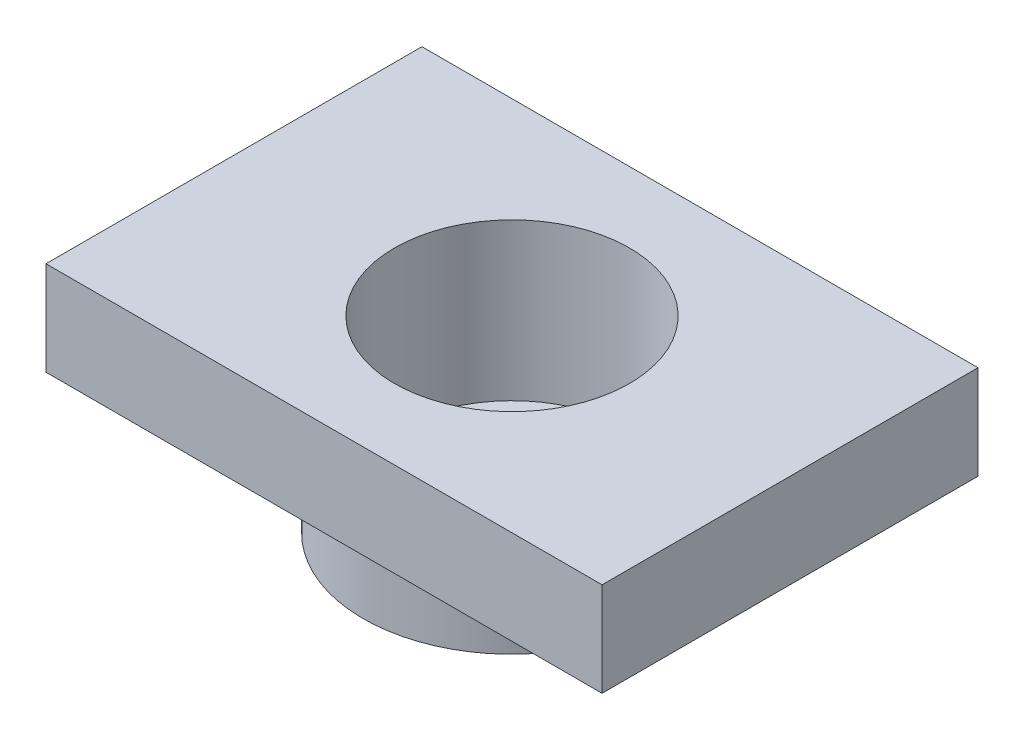
ISO-10303-21;
HEADER;
FILE_DESCRIPTION(('STEP AP214'),'2;1');
FILE_NAME('part.step','',(''),(''),'','','');
FILE_SCHEMA(('AUTOMOTIVE_DESIGN { 1 0 10303 214 1 1 1 1 }'));
ENDSEC;
DATA;
#1=APPLICATION_CONTEXT('core data for automotive mechanical design processes');
#2=APPLICATION_PROTOCOL_DEFINITION('international standard','automotive_design',2000,#1);
#3=PRODUCT_CONTEXT('',#1,'mechanical');
#4=PRODUCT('Part','Part','',(#3));
#5=PRODUCT_RELATED_PRODUCT_CATEGORY('part','',(#4));
#6=PRODUCT_DEFINITION_FORMATION('','',#4);
#7=PRODUCT_DEFINITION_CONTEXT('part definition',#1,'design');
#8=PRODUCT_DEFINITION('design','',#6,#7);
#9=PRODUCT_DEFINITION_SHAPE('','',#8);
#10=(LENGTH_UNIT() NAMED_UNIT(*) SI_UNIT(.MILLI.,.METRE.));
#11=(NAMED_UNIT(*) PLANE_ANGLE_UNIT() SI_UNIT($,.RADIAN.));
#12=(NAMED_UNIT(*) SI_UNIT($,.STERADIAN.) SOLID_ANGLE_UNIT());
#13=UNCERTAINTY_MEASURE_WITH_UNIT(LENGTH_MEASURE(1.E-05),#10,'distance_accuracy_value','');
#14=(GEOMETRIC_REPRESENTATION_CONTEXT(3) GLOBAL_UNCERTAINTY_ASSIGNED_CONTEXT((#13)) GLOBAL_UNIT_ASSIGNED_CONTEXT((#10,
#11,#12)) REPRESENTATION_CONTEXT('',''));
#15=CARTESIAN_POINT('',(0.,0.,0.));
#16=DIRECTION('',(0.,0.,1.));
#17=DIRECTION('',(1.,0.,0.));
#18=AXIS2_PLACEMENT_3D('',#15,#16,#17);
#19=CARTESIAN_POINT('',(59.,0.,0.));
#20=DIRECTION('',(0.,-1.,0.));
#21=DIRECTION('',(1.,0.,0.));
#22=AXIS2_PLACEMENT_3D('',#19,#20,#21);
#23=PLANE('',#22);
#24=CARTESIAN_POINT('',(0.,0.,0.));
#25=DIRECTION('',(0.,1.,0.));
#26=DIRECTION('',(-1.,0.,0.));
#27=AXIS2_PLACEMENT_3D('',#24,#25,#26);
#28=CIRCLE('',#27,15.);
#29=CARTESIAN_POINT('',(-15.,0.,0.));
#30=VERTEX_POINT('',#29);
#31=EDGE_CURVE('E122',#30,#30,#28,.T.);
#32=ORIENTED_EDGE('',*,*,#31,.F.);
#33=EDGE_LOOP('',(#32));
#34=FACE_BOUND('',#33,.T.);
#35=DIRECTION('',(1.,0.,0.));
#36=VECTOR('',#35,1.);
#37=CARTESIAN_POINT('',(35.5,0.,-24.));
#38=LINE('',#37,#36);
#39=CARTESIAN_POINT('',(-35.5000000000001,0.,-24.));
#40=VERTEX_POINT('',#39);
#41=CARTESIAN_POINT('',(35.5,0.,-24.));
#42=VERTEX_POINT('',#41);
#43=EDGE_CURVE('E48',#40,#42,#38,.T.);
#44=ORIENTED_EDGE('',*,*,#43,.F.);
#45=DIRECTION('',(0.,0.,-1.));
#46=VECTOR('',#45,1.);
#47=CARTESIAN_POINT('',(-35.5000000000001,0.,-24.));
#48=LINE('',#47,#46);
#49=CARTESIAN_POINT('',(-35.5000000000001,0.,24.));
#50=VERTEX_POINT('',#49);
#51=EDGE_CURVE('E78',#50,#40,#48,.T.);
#52=ORIENTED_EDGE('',*,*,#51,.F.);
#53=DIRECTION('',(-1.,0.,0.));
#54=VECTOR('',#53,1.);
#55=CARTESIAN_POINT('',(35.5,0.,24.));
#56=LINE('',#55,#54);
#57=CARTESIAN_POINT('',(35.5,0.,24.));
#58=VERTEX_POINT('',#57);
#59=EDGE_CURVE('E85',#58,#50,#56,.T.);
#60=ORIENTED_EDGE('',*,*,#59,.F.);
#61=DIRECTION('',(0.,0.,1.));
#62=VECTOR('',#61,1.);
#63=CARTESIAN_POINT('',(35.5,0.,-24.));
#64=LINE('',#63,#62);
#65=EDGE_CURVE('E90',#42,#58,#64,.T.);
#66=ORIENTED_EDGE('',*,*,#65,.F.);
#67=EDGE_LOOP('',(#44,#52,#60,#66));
#68=FACE_BOUND('',#67,.T.);
#69=ADVANCED_FACE('F32',(#34,#68),#23,.F.);
#70=CARTESIAN_POINT('',(19.,-12.,0.));
#71=DIRECTION('',(0.,1.,0.));
#72=DIRECTION('',(-1.,0.,0.));
#73=AXIS2_PLACEMENT_3D('',#70,#71,#72);
#74=PLANE('',#73);
#75=CARTESIAN_POINT('',(0.,-12.,0.));
#76=DIRECTION('',(0.,1.,0.));
#77=DIRECTION('',(-1.,0.,0.));
#78=AXIS2_PLACEMENT_3D('',#75,#76,#77);
#79=CIRCLE('',#78,19.);
#80=CARTESIAN_POINT('',(-19.,-12.,0.));
#81=VERTEX_POINT('',#80);
#82=EDGE_CURVE('E12',#81,#81,#79,.T.);
#83=ORIENTED_EDGE('',*,*,#82,.T.);
#84=EDGE_LOOP('',(#83));
#85=FACE_BOUND('',#84,.T.);
#86=DIRECTION('',(1.,0.,0.));
#87=VECTOR('',#86,1.);
#88=CARTESIAN_POINT('',(35.5,-12.,-24.));
#89=LINE('',#88,#87);
#90=CARTESIAN_POINT('',(-35.5000000000001,-12.,-24.));
#91=VERTEX_POINT('',#90);
#92=CARTESIAN_POINT('',(35.5,-12.,-24.));
#93=VERTEX_POINT('',#92);
#94=EDGE_CURVE('E97',#91,#93,#89,.T.);
#95=ORIENTED_EDGE('',*,*,#94,.T.);
#96=DIRECTION('',(0.,0.,1.));
#97=VECTOR('',#96,1.);
#98=CARTESIAN_POINT('',(35.5,-12.,-24.));
#99=LINE('',#98,#97);
#100=CARTESIAN_POINT('',(35.5,-12.,24.));
#101=VERTEX_POINT('',#100);
#102=EDGE_CURVE('E100',#93,#101,#99,.T.);
#103=ORIENTED_EDGE('',*,*,#102,.T.);
#104=DIRECTION('',(-1.,0.,0.));
#105=VECTOR('',#104,1.);
#106=CARTESIAN_POINT('',(35.5,-12.,24.));
#107=LINE('',#106,#105);
#108=CARTESIAN_POINT('',(-35.5000000000001,-12.,24.));
#109=VERTEX_POINT('',#108);
#110=EDGE_CURVE('E56',#101,#109,#107,.T.);
#111=ORIENTED_EDGE('',*,*,#110,.T.);
#112=DIRECTION('',(0.,0.,-1.));
#113=VECTOR('',#112,1.);
#114=CARTESIAN_POINT('',(-35.5000000000001,-12.,-24.));
#115=LINE('',#114,#113);
#116=EDGE_CURVE('E80',#109,#91,#115,.T.);
#117=ORIENTED_EDGE('',*,*,#116,.T.);
#118=EDGE_LOOP('',(#95,#103,#111,#117));
#119=FACE_BOUND('',#118,.T.);
#120=ADVANCED_FACE('F162',(#85,#119),#74,.F.);
#121=CARTESIAN_POINT('',(0.,0.,0.));
#122=DIRECTION('',(0.,1.,0.));
#123=DIRECTION('',(-1.,0.,0.));
#124=AXIS2_PLACEMENT_3D('',#121,#122,#123);
#125=CYLINDRICAL_SURFACE('',#124,19.);
#126=ORIENTED_EDGE('',*,*,#82,.F.);
#127=EDGE_LOOP('',(#126));
#128=FACE_BOUND('',#127,.T.);
#129=CARTESIAN_POINT('',(0.,-24.,0.));
#130=DIRECTION('',(0.,1.,0.));
#131=DIRECTION('',(-1.,0.,0.));
#132=AXIS2_PLACEMENT_3D('',#129,#130,#131);
#133=CIRCLE('',#132,19.);
#134=CARTESIAN_POINT('',(-19.,-24.,0.));
#135=VERTEX_POINT('',#134);
#136=EDGE_CURVE('E40',#135,#135,#133,.T.);
#137=ORIENTED_EDGE('',*,*,#136,.T.);
#138=EDGE_LOOP('',(#137));
#139=FACE_BOUND('',#138,.T.);
#140=ADVANCED_FACE('F167',(#128,#139),#125,.T.);
#141=CARTESIAN_POINT('',(9.,-24.,0.));
#142=DIRECTION('',(0.,1.,0.));
#143=DIRECTION('',(-1.,0.,0.));
#144=AXIS2_PLACEMENT_3D('',#141,#142,#143);
#145=PLANE('',#144);
#146=CARTESIAN_POINT('',(-12.9999999999998,-24.,-1.81557108488227E-13));
#147=DIRECTION('',(0.,-1.,0.));
#148=DIRECTION('',(1.,0.,0.));
#149=AXIS2_PLACEMENT_3D('',#146,#147,#148);
#150=CIRCLE('',#149,1.50000000000036);
#151=CARTESIAN_POINT('',(-11.4999999999995,-24.,-1.81557108488227E-13));
#152=VERTEX_POINT('',#151);
#153=EDGE_CURVE('E105',#152,#152,#150,.T.);
#154=ORIENTED_EDGE('',*,*,#153,.F.);
#155=EDGE_LOOP('',(#154));
#156=FACE_BOUND('',#155,.T.);
#157=CARTESIAN_POINT('',(3.6923745097219E-13,-24.,-13.));
#158=DIRECTION('',(0.,-1.,0.));
#159=DIRECTION('',(1.,0.,0.));
#160=AXIS2_PLACEMENT_3D('',#157,#158,#159);
#161=CIRCLE('',#160,1.50000000000044);
#162=CARTESIAN_POINT('',(1.50000000000081,-24.,-13.));
#163=VERTEX_POINT('',#162);
#164=EDGE_CURVE('E110',#163,#163,#161,.T.);
#165=ORIENTED_EDGE('',*,*,#164,.F.);
#166=EDGE_LOOP('',(#165));
#167=FACE_BOUND('',#166,.T.);
#168=CARTESIAN_POINT('',(13.,-24.,0.));
#169=DIRECTION('',(0.,-1.,0.));
#170=DIRECTION('',(1.,0.,0.));
#171=AXIS2_PLACEMENT_3D('',#168,#169,#170);
#172=CIRCLE('',#171,1.5);
#173=CARTESIAN_POINT('',(14.5,-24.,0.));
#174=VERTEX_POINT('',#173);
#175=EDGE_CURVE('E114',#174,#174,#172,.T.);
#176=ORIENTED_EDGE('',*,*,#175,.F.);
#177=EDGE_LOOP('',(#176));
#178=FACE_BOUND('',#177,.T.);
#179=CARTESIAN_POINT('',(0.,-24.,13.));
#180=DIRECTION('',(0.,-1.,0.));
#181=DIRECTION('',(1.,0.,0.));
#182=AXIS2_PLACEMENT_3D('',#179,#180,#181);
#183=CIRCLE('',#182,1.5);
#184=CARTESIAN_POINT('',(1.5,-24.,13.));
#185=VERTEX_POINT('',#184);
#186=EDGE_CURVE('E118',#185,#185,#183,.T.);
#187=ORIENTED_EDGE('',*,*,#186,.F.);
#188=EDGE_LOOP('',(#187));
#189=FACE_BOUND('',#188,.T.);
#190=ORIENTED_EDGE('',*,*,#136,.F.);
#191=EDGE_LOOP('',(#190));
#192=FACE_BOUND('',#191,.T.);
#193=CARTESIAN_POINT('',(0.,-24.,0.));
#194=DIRECTION('',(0.,1.,0.));
#195=DIRECTION('',(-1.,0.,0.));
#196=AXIS2_PLACEMENT_3D('',#193,#194,#195);
#197=CIRCLE('',#196,9.);
#198=CARTESIAN_POINT('',(-8.99999999999999,-24.,0.));
#199=VERTEX_POINT('',#198);
#200=EDGE_CURVE('E131',#199,#199,#197,.T.);
#201=ORIENTED_EDGE('',*,*,#200,.T.);
#202=EDGE_LOOP('',(#201));
#203=FACE_BOUND('',#202,.T.);
#204=ADVANCED_FACE('F188',(#156,#167,#178,#189,#192,#203),#145,.F.);
#205=CARTESIAN_POINT('',(0.,0.,0.));
#206=DIRECTION('',(0.,1.,0.));
#207=DIRECTION('',(-1.,0.,0.));
#208=AXIS2_PLACEMENT_3D('',#205,#206,#207);
#209=CYLINDRICAL_SURFACE('',#208,9.);
#210=ORIENTED_EDGE('',*,*,#200,.F.);
#211=EDGE_LOOP('',(#210));
#212=FACE_BOUND('',#211,.T.);
#213=CARTESIAN_POINT('',(0.,-20.,0.));
#214=DIRECTION('',(0.,1.,0.));
#215=DIRECTION('',(-1.,0.,0.));
#216=AXIS2_PLACEMENT_3D('',#213,#214,#215);
#217=CIRCLE('',#216,9.);
#218=CARTESIAN_POINT('',(-9.,-20.,0.));
#219=VERTEX_POINT('',#218);
#220=EDGE_CURVE('E128',#219,#219,#217,.T.);
#221=ORIENTED_EDGE('',*,*,#220,.T.);
#222=EDGE_LOOP('',(#221));
#223=FACE_BOUND('',#222,.T.);
#224=ADVANCED_FACE('F181',(#212,#223),#209,.F.);
#225=CARTESIAN_POINT('',(15.,-20.,0.));
#226=DIRECTION('',(0.,-1.,0.));
#227=DIRECTION('',(1.,0.,0.));
#228=AXIS2_PLACEMENT_3D('',#225,#226,#227);
#229=PLANE('',#228);
#230=CARTESIAN_POINT('',(-12.9999999999998,-20.,-1.81557108488227E-13));
#231=DIRECTION('',(0.,-1.,0.));
#232=DIRECTION('',(1.,0.,0.));
#233=AXIS2_PLACEMENT_3D('',#230,#231,#232);
#234=CIRCLE('',#233,1.50000000000036);
#235=CARTESIAN_POINT('',(-11.4999999999995,-20.,-1.81557108488227E-13));
#236=VERTEX_POINT('',#235);
#237=EDGE_CURVE('E35',#236,#236,#234,.T.);
#238=ORIENTED_EDGE('',*,*,#237,.T.);
#239=EDGE_LOOP('',(#238));
#240=FACE_BOUND('',#239,.T.);
#241=CARTESIAN_POINT('',(3.68747592252531E-13,-20.,-13.));
#242=DIRECTION('',(0.,-1.,0.));
#243=DIRECTION('',(1.,0.,0.));
#244=AXIS2_PLACEMENT_3D('',#241,#242,#243);
#245=CIRCLE('',#244,1.50000000000044);
#246=CARTESIAN_POINT('',(1.50000000000081,-20.,-13.));
#247=VERTEX_POINT('',#246);
#248=EDGE_CURVE('E113',#247,#247,#245,.T.);
#249=ORIENTED_EDGE('',*,*,#248,.T.);
#250=EDGE_LOOP('',(#249));
#251=FACE_BOUND('',#250,.T.);
#252=CARTESIAN_POINT('',(13.,-20.,0.));
#253=DIRECTION('',(0.,-1.,0.));
#254=DIRECTION('',(1.,0.,0.));
#255=AXIS2_PLACEMENT_3D('',#252,#253,#254);
#256=CIRCLE('',#255,1.5);
#257=CARTESIAN_POINT('',(14.5,-20.,0.));
#258=VERTEX_POINT('',#257);
#259=EDGE_CURVE('E117',#258,#258,#256,.T.);
#260=ORIENTED_EDGE('',*,*,#259,.T.);
#261=EDGE_LOOP('',(#260));
#262=FACE_BOUND('',#261,.T.);
#263=CARTESIAN_POINT('',(0.,-20.,13.));
#264=DIRECTION('',(0.,-1.,0.));
#265=DIRECTION('',(1.,0.,0.));
#266=AXIS2_PLACEMENT_3D('',#263,#264,#265);
#267=CIRCLE('',#266,1.5);
#268=CARTESIAN_POINT('',(1.5,-20.,13.));
#269=VERTEX_POINT('',#268);
#270=EDGE_CURVE('E121',#269,#269,#267,.T.);
#271=ORIENTED_EDGE('',*,*,#270,.T.);
#272=EDGE_LOOP('',(#271));
#273=FACE_BOUND('',#272,.T.);
#274=ORIENTED_EDGE('',*,*,#220,.F.);
#275=EDGE_LOOP('',(#274));
#276=FACE_BOUND('',#275,.T.);
#277=CARTESIAN_POINT('',(0.,-20.,0.));
#278=DIRECTION('',(0.,1.,0.));
#279=DIRECTION('',(-1.,0.,0.));
#280=AXIS2_PLACEMENT_3D('',#277,#278,#279);
#281=CIRCLE('',#280,15.);
#282=CARTESIAN_POINT('',(-15.,-20.,0.));
#283=VERTEX_POINT('',#282);
#284=EDGE_CURVE('E125',#283,#283,#281,.T.);
#285=ORIENTED_EDGE('',*,*,#284,.T.);
#286=EDGE_LOOP('',(#285));
#287=FACE_BOUND('',#286,.T.);
#288=ADVANCED_FACE('F142',(#240,#251,#262,#273,#276,#287),#229,.F.);
#289=CARTESIAN_POINT('',(0.,0.,0.));
#290=DIRECTION('',(0.,1.,0.));
#291=DIRECTION('',(-1.,0.,0.));
#292=AXIS2_PLACEMENT_3D('',#289,#290,#291);
#293=CYLINDRICAL_SURFACE('',#292,15.);
#294=ORIENTED_EDGE('',*,*,#284,.F.);
#295=EDGE_LOOP('',(#294));
#296=FACE_BOUND('',#295,.T.);
#297=ORIENTED_EDGE('',*,*,#31,.T.);
#298=EDGE_LOOP('',(#297));
#299=FACE_BOUND('',#298,.T.);
#300=ADVANCED_FACE('F171',(#296,#299),#293,.F.);
#301=CARTESIAN_POINT('',(0.,0.,13.));
#302=DIRECTION('',(0.,-1.,0.));
#303=DIRECTION('',(1.,0.,0.));
#304=AXIS2_PLACEMENT_3D('',#301,#302,#303);
#305=CYLINDRICAL_SURFACE('',#304,1.5);
#306=ORIENTED_EDGE('',*,*,#186,.T.);
#307=EDGE_LOOP('',(#306));
#308=FACE_BOUND('',#307,.T.);
#309=ORIENTED_EDGE('',*,*,#270,.F.);
#310=EDGE_LOOP('',(#309));
#311=FACE_BOUND('',#310,.T.);
#312=ADVANCED_FACE('F158',(#308,#311),#305,.F.);
#313=CARTESIAN_POINT('',(13.,0.,0.));
#314=DIRECTION('',(0.,-1.,0.));
#315=DIRECTION('',(1.,0.,0.));
#316=AXIS2_PLACEMENT_3D('',#313,#314,#315);
#317=CYLINDRICAL_SURFACE('',#316,1.5);
#318=ORIENTED_EDGE('',*,*,#175,.T.);
#319=EDGE_LOOP('',(#318));
#320=FACE_BOUND('',#319,.T.);
#321=ORIENTED_EDGE('',*,*,#259,.F.);
#322=EDGE_LOOP('',(#321));
#323=FACE_BOUND('',#322,.T.);
#324=ADVANCED_FACE('F148',(#320,#323),#317,.F.);
#325=CARTESIAN_POINT('',(3.66298298654236E-13,0.,-13.));
#326=DIRECTION('',(0.,-1.,0.));
#327=DIRECTION('',(1.,0.,0.));
#328=AXIS2_PLACEMENT_3D('',#325,#326,#327);
#329=CYLINDRICAL_SURFACE('',#328,1.50000000000044);
#330=ORIENTED_EDGE('',*,*,#164,.T.);
#331=EDGE_LOOP('',(#330));
#332=FACE_BOUND('',#331,.T.);
#333=ORIENTED_EDGE('',*,*,#248,.F.);
#334=EDGE_LOOP('',(#333));
#335=FACE_BOUND('',#334,.T.);
#336=ADVANCED_FACE('F145',(#332,#335),#329,.F.);
#337=CARTESIAN_POINT('',(-12.9999999999998,0.,-1.81557108488227E-13));
#338=DIRECTION('',(0.,-1.,0.));
#339=DIRECTION('',(1.,0.,0.));
#340=AXIS2_PLACEMENT_3D('',#337,#338,#339);
#341=CYLINDRICAL_SURFACE('',#340,1.50000000000036);
#342=ORIENTED_EDGE('',*,*,#153,.T.);
#343=EDGE_LOOP('',(#342));
#344=FACE_BOUND('',#343,.T.);
#345=ORIENTED_EDGE('',*,*,#237,.F.);
#346=EDGE_LOOP('',(#345));
#347=FACE_BOUND('',#346,.T.);
#348=ADVANCED_FACE('F147',(#344,#347),#341,.F.);
#349=CARTESIAN_POINT('',(35.5,0.,-24.));
#350=DIRECTION('',(0.,0.,-1.));
#351=DIRECTION('',(-1.,0.,0.));
#352=AXIS2_PLACEMENT_3D('',#349,#350,#351);
#353=PLANE('',#352);
#354=ORIENTED_EDGE('',*,*,#94,.F.);
#355=DIRECTION('',(0.,-1.,0.));
#356=VECTOR('',#355,1.);
#357=CARTESIAN_POINT('',(-35.5000000000001,0.,-24.));
#358=LINE('',#357,#356);
#359=EDGE_CURVE('E81',#40,#91,#358,.T.);
#360=ORIENTED_EDGE('',*,*,#359,.F.);
#361=ORIENTED_EDGE('',*,*,#43,.T.);
#362=DIRECTION('',(0.,-1.,0.));
#363=VECTOR('',#362,1.);
#364=CARTESIAN_POINT('',(35.5,0.,-24.));
#365=LINE('',#364,#363);
#366=EDGE_CURVE('E92',#42,#93,#365,.T.);
#367=ORIENTED_EDGE('',*,*,#366,.T.);
#368=EDGE_LOOP('',(#354,#360,#361,#367));
#369=FACE_BOUND('',#368,.T.);
#370=ADVANCED_FACE('F155',(#369),#353,.T.);
#371=CARTESIAN_POINT('',(-35.5000000000001,0.,-24.));
#372=DIRECTION('',(-1.,0.,0.));
#373=DIRECTION('',(0.,0.,1.));
#374=AXIS2_PLACEMENT_3D('',#371,#372,#373);
#375=PLANE('',#374);
#376=ORIENTED_EDGE('',*,*,#116,.F.);
#377=DIRECTION('',(0.,-1.,0.));
#378=VECTOR('',#377,1.);
#379=CARTESIAN_POINT('',(-35.5000000000001,0.,24.));
#380=LINE('',#379,#378);
#381=EDGE_CURVE('E74',#50,#109,#380,.T.);
#382=ORIENTED_EDGE('',*,*,#381,.F.);
#383=ORIENTED_EDGE('',*,*,#51,.T.);
#384=ORIENTED_EDGE('',*,*,#359,.T.);
#385=EDGE_LOOP('',(#376,#382,#383,#384));
#386=FACE_BOUND('',#385,.T.);
#387=ADVANCED_FACE('F76',(#386),#375,.T.);
#388=CARTESIAN_POINT('',(35.5,0.,24.));
#389=DIRECTION('',(0.,0.,1.));
#390=DIRECTION('',(1.,0.,0.));
#391=AXIS2_PLACEMENT_3D('',#388,#389,#390);
#392=PLANE('',#391);
#393=ORIENTED_EDGE('',*,*,#110,.F.);
#394=DIRECTION('',(0.,-1.,0.));
#395=VECTOR('',#394,1.);
#396=CARTESIAN_POINT('',(35.5,0.,24.));
#397=LINE('',#396,#395);
#398=EDGE_CURVE('E82',#58,#101,#397,.T.);
#399=ORIENTED_EDGE('',*,*,#398,.F.);
#400=ORIENTED_EDGE('',*,*,#59,.T.);
#401=ORIENTED_EDGE('',*,*,#381,.T.);
#402=EDGE_LOOP('',(#393,#399,#400,#401));
#403=FACE_BOUND('',#402,.T.);
#404=ADVANCED_FACE('F86',(#403),#392,.T.);
#405=CARTESIAN_POINT('',(35.5,0.,-24.));
#406=DIRECTION('',(1.,0.,0.));
#407=DIRECTION('',(0.,0.,-1.));
#408=AXIS2_PLACEMENT_3D('',#405,#406,#407);
#409=PLANE('',#408);
#410=ORIENTED_EDGE('',*,*,#102,.F.);
#411=ORIENTED_EDGE('',*,*,#366,.F.);
#412=ORIENTED_EDGE('',*,*,#65,.T.);
#413=ORIENTED_EDGE('',*,*,#398,.T.);
#414=EDGE_LOOP('',(#410,#411,#412,#413));
#415=FACE_BOUND('',#414,.T.);
#416=ADVANCED_FACE('F211',(#415),#409,.T.);
#417=CLOSED_SHELL('',(#69,#120,#140,#204,#224,#288,#300,#312,#324,#336,#348,#370,#387,#404,#416));
#418=MANIFOLD_SOLID_BREP('B2',#417);
#419=ADVANCED_BREP_SHAPE_REPRESENTATION('',(#18,#418),#14);
#420=SHAPE_DEFINITION_REPRESENTATION(#9,#419);
ENDSEC;
END-ISO-10303-21;
